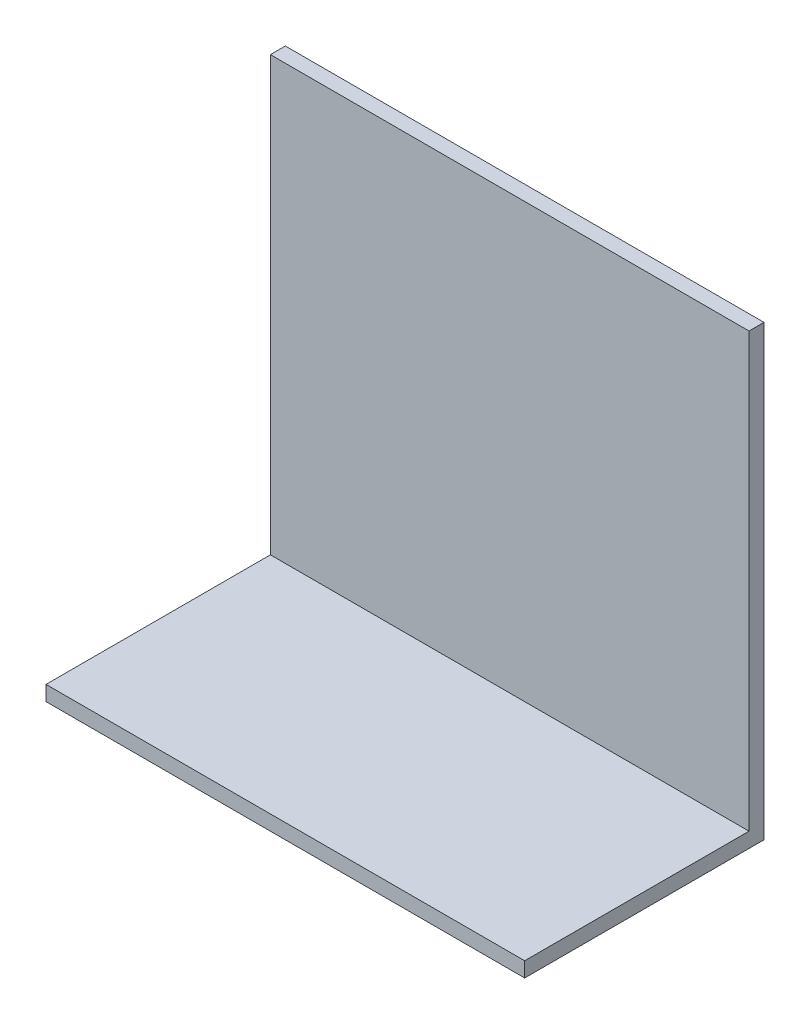
ISO-10303-21;
HEADER;
FILE_DESCRIPTION(('STEP AP214'),'2;1');
FILE_NAME('part.step','',(''),(''),'','','');
FILE_SCHEMA(('AUTOMOTIVE_DESIGN { 1 0 10303 214 1 1 1 1 }'));
ENDSEC;
DATA;
#1=APPLICATION_CONTEXT('core data for automotive mechanical design processes');
#2=APPLICATION_PROTOCOL_DEFINITION('international standard','automotive_design',2000,#1);
#3=PRODUCT_CONTEXT('',#1,'mechanical');
#4=PRODUCT('Part','Part','',(#3));
#5=PRODUCT_RELATED_PRODUCT_CATEGORY('part','',(#4));
#6=PRODUCT_DEFINITION_FORMATION('','',#4);
#7=PRODUCT_DEFINITION_CONTEXT('part definition',#1,'design');
#8=PRODUCT_DEFINITION('design','',#6,#7);
#9=PRODUCT_DEFINITION_SHAPE('','',#8);
#10=(LENGTH_UNIT() NAMED_UNIT(*) SI_UNIT(.MILLI.,.METRE.));
#11=(NAMED_UNIT(*) PLANE_ANGLE_UNIT() SI_UNIT($,.RADIAN.));
#12=(NAMED_UNIT(*) SI_UNIT($,.STERADIAN.) SOLID_ANGLE_UNIT());
#13=UNCERTAINTY_MEASURE_WITH_UNIT(LENGTH_MEASURE(1.E-05),#10,'distance_accuracy_value','');
#14=(GEOMETRIC_REPRESENTATION_CONTEXT(3) GLOBAL_UNCERTAINTY_ASSIGNED_CONTEXT((#13)) GLOBAL_UNIT_ASSIGNED_CONTEXT((#10,
#11,#12)) REPRESENTATION_CONTEXT('',''));
#15=CARTESIAN_POINT('',(0.,0.,0.));
#16=DIRECTION('',(0.,0.,1.));
#17=DIRECTION('',(1.,0.,0.));
#18=AXIS2_PLACEMENT_3D('',#15,#16,#17);
#19=CARTESIAN_POINT('',(0.,0.,3.175));
#20=DIRECTION('',(0.,0.,1.));
#21=DIRECTION('',(1.,0.,0.));
#22=AXIS2_PLACEMENT_3D('',#19,#20,#21);
#23=PLANE('',#22);
#24=DIRECTION('',(0.,-1.,0.));
#25=VECTOR('',#24,1.);
#26=CARTESIAN_POINT('',(-46.2158462070897,66.3829949176516,3.175));
#27=LINE('',#26,#25);
#28=CARTESIAN_POINT('',(-46.2158462070897,66.3829949176516,3.175));
#29=VERTEX_POINT('',#28);
#30=CARTESIAN_POINT('',(-46.2158462070897,-25.5650050823484,3.175));
#31=VERTEX_POINT('',#30);
#32=EDGE_CURVE('E66',#29,#31,#27,.T.);
#33=ORIENTED_EDGE('',*,*,#32,.T.);
#34=DIRECTION('',(1.,0.,0.));
#35=VECTOR('',#34,1.);
#36=CARTESIAN_POINT('',(0.,-25.5650050823484,3.175));
#37=LINE('',#36,#35);
#38=CARTESIAN_POINT('',(55.3841537929104,-25.5650050823484,3.175));
#39=VERTEX_POINT('',#38);
#40=EDGE_CURVE('E58',#31,#39,#37,.T.);
#41=ORIENTED_EDGE('',*,*,#40,.T.);
#42=DIRECTION('',(0.,1.,0.));
#43=VECTOR('',#42,1.);
#44=CARTESIAN_POINT('',(55.3841537929103,66.3829949176516,3.175));
#45=LINE('',#44,#43);
#46=CARTESIAN_POINT('',(55.3841537929103,66.3829949176516,3.175));
#47=VERTEX_POINT('',#46);
#48=EDGE_CURVE('E111',#39,#47,#45,.T.);
#49=ORIENTED_EDGE('',*,*,#48,.T.);
#50=DIRECTION('',(-1.,0.,0.));
#51=VECTOR('',#50,1.);
#52=CARTESIAN_POINT('',(-46.2158462070897,66.3829949176516,3.175));
#53=LINE('',#52,#51);
#54=EDGE_CURVE('E144',#47,#29,#53,.T.);
#55=ORIENTED_EDGE('',*,*,#54,.T.);
#56=EDGE_LOOP('',(#33,#41,#49,#55));
#57=FACE_BOUND('',#56,.T.);
#58=ADVANCED_FACE('F39',(#57),#23,.T.);
#59=CARTESIAN_POINT('',(-46.2158462070897,66.3829949176516,3.175));
#60=DIRECTION('',(1.,0.,0.));
#61=DIRECTION('',(0.,1.,0.));
#62=AXIS2_PLACEMENT_3D('',#59,#60,#61);
#63=PLANE('',#62);
#64=DIRECTION('',(0.,0.,-1.));
#65=VECTOR('',#64,1.);
#66=CARTESIAN_POINT('',(-46.2158462070897,-28.7400050823484,3.175));
#67=LINE('',#66,#65);
#68=CARTESIAN_POINT('',(-46.2158462070896,-28.7400050823484,50.8));
#69=VERTEX_POINT('',#68);
#70=CARTESIAN_POINT('',(-46.2158462070897,-28.7400050823484,0.));
#71=VERTEX_POINT('',#70);
#72=EDGE_CURVE('E11',#69,#71,#67,.T.);
#73=ORIENTED_EDGE('',*,*,#72,.F.);
#74=DIRECTION('',(0.,-1.,0.));
#75=VECTOR('',#74,1.);
#76=CARTESIAN_POINT('',(-46.2158462070896,-25.5650050823484,50.8));
#77=LINE('',#76,#75);
#78=CARTESIAN_POINT('',(-46.2158462070896,-25.5650050823484,50.8));
#79=VERTEX_POINT('',#78);
#80=EDGE_CURVE('E129',#79,#69,#77,.T.);
#81=ORIENTED_EDGE('',*,*,#80,.F.);
#82=DIRECTION('',(0.,0.,1.));
#83=VECTOR('',#82,1.);
#84=CARTESIAN_POINT('',(-46.2158462070896,-25.5650050823484,0.));
#85=LINE('',#84,#83);
#86=EDGE_CURVE('E114',#31,#79,#85,.T.);
#87=ORIENTED_EDGE('',*,*,#86,.F.);
#88=ORIENTED_EDGE('',*,*,#32,.F.);
#89=DIRECTION('',(0.,0.,-1.));
#90=VECTOR('',#89,1.);
#91=CARTESIAN_POINT('',(-46.2158462070897,66.3829949176516,3.175));
#92=LINE('',#91,#90);
#93=CARTESIAN_POINT('',(-46.2158462070897,66.3829949176516,0.));
#94=VERTEX_POINT('',#93);
#95=EDGE_CURVE('E147',#29,#94,#92,.T.);
#96=ORIENTED_EDGE('',*,*,#95,.T.);
#97=DIRECTION('',(0.,-1.,0.));
#98=VECTOR('',#97,1.);
#99=CARTESIAN_POINT('',(-46.2158462070897,66.3829949176516,0.));
#100=LINE('',#99,#98);
#101=EDGE_CURVE('E133',#94,#71,#100,.T.);
#102=ORIENTED_EDGE('',*,*,#101,.T.);
#103=EDGE_LOOP('',(#73,#81,#87,#88,#96,#102));
#104=FACE_BOUND('',#103,.T.);
#105=ADVANCED_FACE('F41',(#104),#63,.F.);
#106=CARTESIAN_POINT('',(-46.2158462070897,-28.7400050823484,3.175));
#107=DIRECTION('',(0.,1.,0.));
#108=DIRECTION('',(0.,0.,1.));
#109=AXIS2_PLACEMENT_3D('',#106,#107,#108);
#110=PLANE('',#109);
#111=DIRECTION('',(1.,0.,0.));
#112=VECTOR('',#111,1.);
#113=CARTESIAN_POINT('',(-46.2158462070897,-28.7400050823484,0.));
#114=LINE('',#113,#112);
#115=CARTESIAN_POINT('',(55.3841537929104,-28.7400050823484,0.));
#116=VERTEX_POINT('',#115);
#117=EDGE_CURVE('E150',#71,#116,#114,.T.);
#118=ORIENTED_EDGE('',*,*,#117,.T.);
#119=DIRECTION('',(0.,0.,-1.));
#120=VECTOR('',#119,1.);
#121=CARTESIAN_POINT('',(55.3841537929104,-28.7400050823484,3.175));
#122=LINE('',#121,#120);
#123=CARTESIAN_POINT('',(55.3841537929103,-28.7400050823484,50.8));
#124=VERTEX_POINT('',#123);
#125=EDGE_CURVE('E48',#124,#116,#122,.T.);
#126=ORIENTED_EDGE('',*,*,#125,.F.);
#127=DIRECTION('',(1.,0.,0.));
#128=VECTOR('',#127,1.);
#129=CARTESIAN_POINT('',(-46.2158462070896,-28.7400050823484,50.8));
#130=LINE('',#129,#128);
#131=EDGE_CURVE('E124',#69,#124,#130,.T.);
#132=ORIENTED_EDGE('',*,*,#131,.F.);
#133=ORIENTED_EDGE('',*,*,#72,.T.);
#134=EDGE_LOOP('',(#118,#126,#132,#133));
#135=FACE_BOUND('',#134,.T.);
#136=ADVANCED_FACE('F179',(#135),#110,.F.);
#137=CARTESIAN_POINT('',(55.3841537929103,66.3829949176516,3.175));
#138=DIRECTION('',(-1.,0.,0.));
#139=DIRECTION('',(0.,-1.,0.));
#140=AXIS2_PLACEMENT_3D('',#137,#138,#139);
#141=PLANE('',#140);
#142=DIRECTION('',(0.,1.,0.));
#143=VECTOR('',#142,1.);
#144=CARTESIAN_POINT('',(55.3841537929103,66.3829949176516,0.));
#145=LINE('',#144,#143);
#146=CARTESIAN_POINT('',(55.3841537929103,66.3829949176516,0.));
#147=VERTEX_POINT('',#146);
#148=EDGE_CURVE('E153',#116,#147,#145,.T.);
#149=ORIENTED_EDGE('',*,*,#148,.T.);
#150=DIRECTION('',(0.,0.,-1.));
#151=VECTOR('',#150,1.);
#152=CARTESIAN_POINT('',(55.3841537929103,66.3829949176516,3.175));
#153=LINE('',#152,#151);
#154=EDGE_CURVE('E161',#47,#147,#153,.T.);
#155=ORIENTED_EDGE('',*,*,#154,.F.);
#156=ORIENTED_EDGE('',*,*,#48,.F.);
#157=DIRECTION('',(0.,0.,1.));
#158=VECTOR('',#157,1.);
#159=CARTESIAN_POINT('',(55.3841537929104,-25.5650050823484,0.));
#160=LINE('',#159,#158);
#161=CARTESIAN_POINT('',(55.3841537929103,-25.5650050823484,50.8));
#162=VERTEX_POINT('',#161);
#163=EDGE_CURVE('E103',#39,#162,#160,.T.);
#164=ORIENTED_EDGE('',*,*,#163,.T.);
#165=DIRECTION('',(0.,-1.,0.));
#166=VECTOR('',#165,1.);
#167=CARTESIAN_POINT('',(55.3841537929103,-25.5650050823484,50.8));
#168=LINE('',#167,#166);
#169=EDGE_CURVE('E108',#162,#124,#168,.T.);
#170=ORIENTED_EDGE('',*,*,#169,.T.);
#171=ORIENTED_EDGE('',*,*,#125,.T.);
#172=EDGE_LOOP('',(#149,#155,#156,#164,#170,#171));
#173=FACE_BOUND('',#172,.T.);
#174=ADVANCED_FACE('F105',(#173),#141,.F.);
#175=CARTESIAN_POINT('',(-46.2158462070897,66.3829949176516,3.175));
#176=DIRECTION('',(0.,-1.,0.));
#177=DIRECTION('',(0.,0.,-1.));
#178=AXIS2_PLACEMENT_3D('',#175,#176,#177);
#179=PLANE('',#178);
#180=DIRECTION('',(-1.,0.,0.));
#181=VECTOR('',#180,1.);
#182=CARTESIAN_POINT('',(-46.2158462070897,66.3829949176516,0.));
#183=LINE('',#182,#181);
#184=EDGE_CURVE('E141',#147,#94,#183,.T.);
#185=ORIENTED_EDGE('',*,*,#184,.T.);
#186=ORIENTED_EDGE('',*,*,#95,.F.);
#187=ORIENTED_EDGE('',*,*,#54,.F.);
#188=ORIENTED_EDGE('',*,*,#154,.T.);
#189=EDGE_LOOP('',(#185,#186,#187,#188));
#190=FACE_BOUND('',#189,.T.);
#191=ADVANCED_FACE('F174',(#190),#179,.F.);
#192=CARTESIAN_POINT('',(0.,0.,0.));
#193=DIRECTION('',(0.,0.,1.));
#194=DIRECTION('',(1.,0.,0.));
#195=AXIS2_PLACEMENT_3D('',#192,#193,#194);
#196=PLANE('',#195);
#197=ORIENTED_EDGE('',*,*,#117,.F.);
#198=ORIENTED_EDGE('',*,*,#101,.F.);
#199=ORIENTED_EDGE('',*,*,#184,.F.);
#200=ORIENTED_EDGE('',*,*,#148,.F.);
#201=EDGE_LOOP('',(#197,#198,#199,#200));
#202=FACE_BOUND('',#201,.T.);
#203=ADVANCED_FACE('F170',(#202),#196,.F.);
#204=CARTESIAN_POINT('',(-46.2158462070896,-25.5650050823484,50.8));
#205=DIRECTION('',(0.,0.,-1.));
#206=DIRECTION('',(-1.,0.,0.));
#207=AXIS2_PLACEMENT_3D('',#204,#205,#206);
#208=PLANE('',#207);
#209=ORIENTED_EDGE('',*,*,#131,.T.);
#210=ORIENTED_EDGE('',*,*,#169,.F.);
#211=DIRECTION('',(1.,0.,0.));
#212=VECTOR('',#211,1.);
#213=CARTESIAN_POINT('',(-46.2158462070896,-25.5650050823484,50.8));
#214=LINE('',#213,#212);
#215=EDGE_CURVE('E115',#79,#162,#214,.T.);
#216=ORIENTED_EDGE('',*,*,#215,.F.);
#217=ORIENTED_EDGE('',*,*,#80,.T.);
#218=EDGE_LOOP('',(#209,#210,#216,#217));
#219=FACE_BOUND('',#218,.T.);
#220=ADVANCED_FACE('F126',(#219),#208,.F.);
#221=CARTESIAN_POINT('',(0.,-25.5650050823484,0.));
#222=DIRECTION('',(0.,-1.,0.));
#223=DIRECTION('',(0.,0.,-1.));
#224=AXIS2_PLACEMENT_3D('',#221,#222,#223);
#225=PLANE('',#224);
#226=ORIENTED_EDGE('',*,*,#40,.F.);
#227=ORIENTED_EDGE('',*,*,#86,.T.);
#228=ORIENTED_EDGE('',*,*,#215,.T.);
#229=ORIENTED_EDGE('',*,*,#163,.F.);
#230=EDGE_LOOP('',(#226,#227,#228,#229));
#231=FACE_BOUND('',#230,.T.);
#232=ADVANCED_FACE('F118',(#231),#225,.F.);
#233=CLOSED_SHELL('',(#58,#105,#136,#174,#191,#203,#220,#232));
#234=MANIFOLD_SOLID_BREP('B2',#233);
#235=ADVANCED_BREP_SHAPE_REPRESENTATION('',(#18,#234),#14);
#236=SHAPE_DEFINITION_REPRESENTATION(#9,#235);
ENDSEC;
END-ISO-10303-21;
